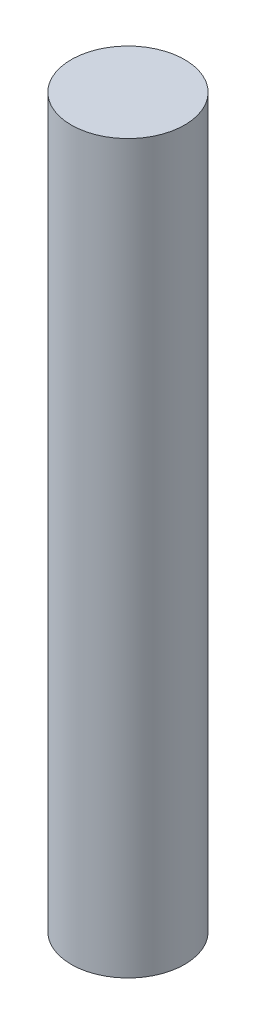
ISO-10303-21;
HEADER;
FILE_DESCRIPTION(('STEP AP214'),'2;1');
FILE_NAME('part.step','',(''),(''),'','','');
FILE_SCHEMA(('AUTOMOTIVE_DESIGN { 1 0 10303 214 1 1 1 1 }'));
ENDSEC;
DATA;
#1=APPLICATION_CONTEXT('core data for automotive mechanical design processes');
#2=APPLICATION_PROTOCOL_DEFINITION('international standard','automotive_design',2000,#1);
#3=PRODUCT_CONTEXT('',#1,'mechanical');
#4=PRODUCT('Part','Part','',(#3));
#5=PRODUCT_RELATED_PRODUCT_CATEGORY('part','',(#4));
#6=PRODUCT_DEFINITION_FORMATION('','',#4);
#7=PRODUCT_DEFINITION_CONTEXT('part definition',#1,'design');
#8=PRODUCT_DEFINITION('design','',#6,#7);
#9=PRODUCT_DEFINITION_SHAPE('','',#8);
#10=(LENGTH_UNIT() NAMED_UNIT(*) SI_UNIT(.MILLI.,.METRE.));
#11=(NAMED_UNIT(*) PLANE_ANGLE_UNIT() SI_UNIT($,.RADIAN.));
#12=(NAMED_UNIT(*) SI_UNIT($,.STERADIAN.) SOLID_ANGLE_UNIT());
#13=UNCERTAINTY_MEASURE_WITH_UNIT(LENGTH_MEASURE(1.E-05),#10,'distance_accuracy_value','');
#14=(GEOMETRIC_REPRESENTATION_CONTEXT(3) GLOBAL_UNCERTAINTY_ASSIGNED_CONTEXT((#13)) GLOBAL_UNIT_ASSIGNED_CONTEXT((#10,
#11,#12)) REPRESENTATION_CONTEXT('',''));
#15=CARTESIAN_POINT('',(0.,0.,0.));
#16=DIRECTION('',(0.,0.,1.));
#17=DIRECTION('',(1.,0.,0.));
#18=AXIS2_PLACEMENT_3D('',#15,#16,#17);
#19=CARTESIAN_POINT('',(0.,50.,0.));
#20=DIRECTION('',(0.,-1.,0.));
#21=DIRECTION('',(0.,0.,-1.));
#22=AXIS2_PLACEMENT_3D('',#19,#20,#21);
#23=CYLINDRICAL_SURFACE('',#22,3.9);
#24=CARTESIAN_POINT('',(0.,50.,0.));
#25=DIRECTION('',(0.,1.,0.));
#26=DIRECTION('',(0.,0.,1.));
#27=AXIS2_PLACEMENT_3D('',#24,#25,#26);
#28=CIRCLE('',#27,3.9);
#29=CARTESIAN_POINT('',(0.,50.,3.9));
#30=VERTEX_POINT('',#29);
#31=EDGE_CURVE('E10',#30,#30,#28,.T.);
#32=ORIENTED_EDGE('',*,*,#31,.F.);
#33=EDGE_LOOP('',(#32));
#34=FACE_BOUND('',#33,.T.);
#35=CARTESIAN_POINT('',(0.,0.,0.));
#36=DIRECTION('',(0.,1.,0.));
#37=DIRECTION('',(0.,0.,1.));
#38=AXIS2_PLACEMENT_3D('',#35,#36,#37);
#39=CIRCLE('',#38,3.9);
#40=CARTESIAN_POINT('',(0.,0.,3.9));
#41=VERTEX_POINT('',#40);
#42=EDGE_CURVE('E34',#41,#41,#39,.T.);
#43=ORIENTED_EDGE('',*,*,#42,.T.);
#44=EDGE_LOOP('',(#43));
#45=FACE_BOUND('',#44,.T.);
#46=ADVANCED_FACE('F31',(#34,#45),#23,.T.);
#47=CARTESIAN_POINT('',(0.,50.,0.));
#48=DIRECTION('',(0.,1.,0.));
#49=DIRECTION('',(0.,0.,1.));
#50=AXIS2_PLACEMENT_3D('',#47,#48,#49);
#51=PLANE('',#50);
#52=ORIENTED_EDGE('',*,*,#31,.T.);
#53=EDGE_LOOP('',(#52));
#54=FACE_BOUND('',#53,.T.);
#55=ADVANCED_FACE('F46',(#54),#51,.T.);
#56=CARTESIAN_POINT('',(0.,0.,0.));
#57=DIRECTION('',(0.,1.,0.));
#58=DIRECTION('',(0.,0.,1.));
#59=AXIS2_PLACEMENT_3D('',#56,#57,#58);
#60=PLANE('',#59);
#61=ORIENTED_EDGE('',*,*,#42,.F.);
#62=EDGE_LOOP('',(#61));
#63=FACE_BOUND('',#62,.T.);
#64=ADVANCED_FACE('F44',(#63),#60,.F.);
#65=CLOSED_SHELL('',(#46,#55,#64));
#66=MANIFOLD_SOLID_BREP('B2',#65);
#67=ADVANCED_BREP_SHAPE_REPRESENTATION('',(#18,#66),#14);
#68=SHAPE_DEFINITION_REPRESENTATION(#9,#67);
ENDSEC;
END-ISO-10303-21;
